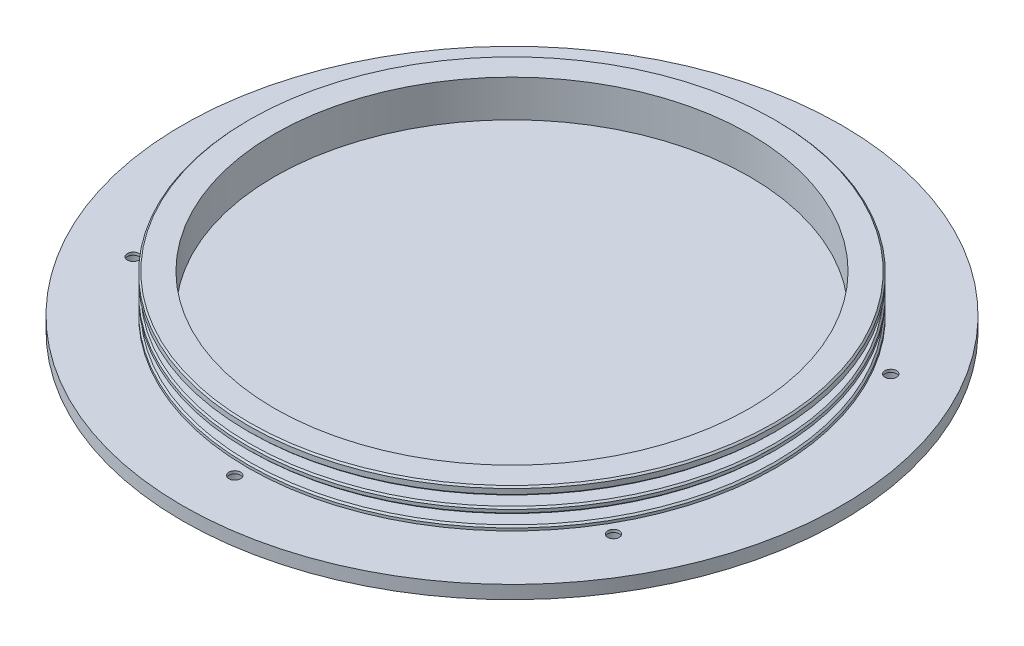
ISO-10303-21;
HEADER;
FILE_DESCRIPTION(('STEP AP214'),'2;1');
FILE_NAME('part.step','',(''),(''),'','','');
FILE_SCHEMA(('AUTOMOTIVE_DESIGN { 1 0 10303 214 1 1 1 1 }'));
ENDSEC;
DATA;
#1=APPLICATION_CONTEXT('core data for automotive mechanical design processes');
#2=APPLICATION_PROTOCOL_DEFINITION('international standard','automotive_design',2000,#1);
#3=PRODUCT_CONTEXT('',#1,'mechanical');
#4=PRODUCT('Part','Part','',(#3));
#5=PRODUCT_RELATED_PRODUCT_CATEGORY('part','',(#4));
#6=PRODUCT_DEFINITION_FORMATION('','',#4);
#7=PRODUCT_DEFINITION_CONTEXT('part definition',#1,'design');
#8=PRODUCT_DEFINITION('design','',#6,#7);
#9=PRODUCT_DEFINITION_SHAPE('','',#8);
#10=(LENGTH_UNIT() NAMED_UNIT(*) SI_UNIT(.MILLI.,.METRE.));
#11=(NAMED_UNIT(*) PLANE_ANGLE_UNIT() SI_UNIT($,.RADIAN.));
#12=(NAMED_UNIT(*) SI_UNIT($,.STERADIAN.) SOLID_ANGLE_UNIT());
#13=UNCERTAINTY_MEASURE_WITH_UNIT(LENGTH_MEASURE(1.E-05),#10,'distance_accuracy_value','');
#14=(GEOMETRIC_REPRESENTATION_CONTEXT(3) GLOBAL_UNCERTAINTY_ASSIGNED_CONTEXT((#13)) GLOBAL_UNIT_ASSIGNED_CONTEXT((#10,
#11,#12)) REPRESENTATION_CONTEXT('',''));
#15=CARTESIAN_POINT('',(0.,0.,0.));
#16=DIRECTION('',(0.,0.,1.));
#17=DIRECTION('',(1.,0.,0.));
#18=AXIS2_PLACEMENT_3D('',#15,#16,#17);
#19=CARTESIAN_POINT('',(0.,12.3825,0.));
#20=DIRECTION('',(0.,-1.,0.));
#21=DIRECTION('',(0.,0.,-1.));
#22=AXIS2_PLACEMENT_3D('',#19,#20,#21);
#23=CYLINDRICAL_SURFACE('',#22,63.5);
#24=CARTESIAN_POINT('',(0.,6.92263972647447,0.));
#25=DIRECTION('',(0.,-1.,0.));
#26=DIRECTION('',(0.,0.,-1.));
#27=AXIS2_PLACEMENT_3D('',#24,#25,#26);
#28=CIRCLE('',#27,63.5);
#29=CARTESIAN_POINT('',(0.,6.92263972647447,-63.5));
#30=VERTEX_POINT('',#29);
#31=EDGE_CURVE('E45',#30,#30,#28,.F.);
#32=ORIENTED_EDGE('',*,*,#31,.T.);
#33=EDGE_LOOP('',(#32));
#34=FACE_BOUND('',#33,.T.);
#35=CARTESIAN_POINT('',(0.,7.66193475746577,0.));
#36=DIRECTION('',(0.,1.,0.));
#37=DIRECTION('',(0.,0.,1.));
#38=AXIS2_PLACEMENT_3D('',#35,#36,#37);
#39=CIRCLE('',#38,63.5);
#40=CARTESIAN_POINT('',(0.,7.66193475746577,63.5));
#41=VERTEX_POINT('',#40);
#42=EDGE_CURVE('E156',#41,#41,#39,.F.);
#43=ORIENTED_EDGE('',*,*,#42,.T.);
#44=EDGE_LOOP('',(#43));
#45=FACE_BOUND('',#44,.T.);
#46=ADVANCED_FACE('F32',(#34,#45),#23,.T.);
#47=CARTESIAN_POINT('',(0.,8.04293475746576,63.5));
#48=DIRECTION('',(0.,1.,0.));
#49=DIRECTION('',(0.,0.,1.));
#50=AXIS2_PLACEMENT_3D('',#47,#48,#49);
#51=PLANE('',#50);
#52=CARTESIAN_POINT('',(0.,8.04293475746576,0.));
#53=DIRECTION('',(0.,1.,0.));
#54=DIRECTION('',(0.,0.,1.));
#55=AXIS2_PLACEMENT_3D('',#52,#53,#54);
#56=CIRCLE('',#55,63.119);
#57=CARTESIAN_POINT('',(0.,8.04293475746576,63.119));
#58=VERTEX_POINT('',#57);
#59=EDGE_CURVE('E40',#58,#58,#56,.T.);
#60=ORIENTED_EDGE('',*,*,#59,.T.);
#61=EDGE_LOOP('',(#60));
#62=FACE_BOUND('',#61,.T.);
#63=CARTESIAN_POINT('',(0.,8.04293475746576,0.));
#64=DIRECTION('',(0.,-1.,0.));
#65=DIRECTION('',(0.,0.,-1.));
#66=AXIS2_PLACEMENT_3D('',#63,#64,#65);
#67=CIRCLE('',#66,59.69);
#68=CARTESIAN_POINT('',(0.,8.04293475746576,-59.69));
#69=VERTEX_POINT('',#68);
#70=EDGE_CURVE('E126',#69,#69,#67,.T.);
#71=ORIENTED_EDGE('',*,*,#70,.T.);
#72=EDGE_LOOP('',(#71));
#73=FACE_BOUND('',#72,.T.);
#74=ADVANCED_FACE('F198',(#62,#73),#51,.T.);
#75=CARTESIAN_POINT('',(0.,0.,0.));
#76=DIRECTION('',(0.,-1.,0.));
#77=DIRECTION('',(0.,0.,-1.));
#78=AXIS2_PLACEMENT_3D('',#75,#76,#77);
#79=CYLINDRICAL_SURFACE('',#78,59.69);
#80=CARTESIAN_POINT('',(0.,10.4051347574658,0.));
#81=DIRECTION('',(0.,-1.,0.));
#82=DIRECTION('',(0.,0.,-1.));
#83=AXIS2_PLACEMENT_3D('',#80,#81,#82);
#84=CIRCLE('',#83,59.69);
#85=CARTESIAN_POINT('',(0.,10.4051347574658,-59.69));
#86=VERTEX_POINT('',#85);
#87=EDGE_CURVE('E123',#86,#86,#84,.T.);
#88=ORIENTED_EDGE('',*,*,#87,.T.);
#89=EDGE_LOOP('',(#88));
#90=FACE_BOUND('',#89,.T.);
#91=ORIENTED_EDGE('',*,*,#70,.F.);
#92=EDGE_LOOP('',(#91));
#93=FACE_BOUND('',#92,.T.);
#94=ADVANCED_FACE('F202',(#90,#93),#79,.T.);
#95=CARTESIAN_POINT('',(0.,10.4051347574658,63.5));
#96=DIRECTION('',(0.,-1.,0.));
#97=DIRECTION('',(0.,0.,-1.));
#98=AXIS2_PLACEMENT_3D('',#95,#96,#97);
#99=PLANE('',#98);
#100=CARTESIAN_POINT('',(0.,10.4051347574658,0.));
#101=DIRECTION('',(0.,-1.,0.));
#102=DIRECTION('',(0.,0.,-1.));
#103=AXIS2_PLACEMENT_3D('',#100,#101,#102);
#104=CIRCLE('',#103,63.119);
#105=CARTESIAN_POINT('',(0.,10.4051347574658,-63.119));
#106=VERTEX_POINT('',#105);
#107=EDGE_CURVE('E10',#106,#106,#104,.T.);
#108=ORIENTED_EDGE('',*,*,#107,.T.);
#109=EDGE_LOOP('',(#108));
#110=FACE_BOUND('',#109,.T.);
#111=ORIENTED_EDGE('',*,*,#87,.F.);
#112=EDGE_LOOP('',(#111));
#113=FACE_BOUND('',#112,.T.);
#114=ADVANCED_FACE('F245',(#110,#113),#99,.T.);
#115=CARTESIAN_POINT('',(0.,12.3825,0.));
#116=DIRECTION('',(0.,1.,0.));
#117=DIRECTION('',(0.,0.,1.));
#118=AXIS2_PLACEMENT_3D('',#115,#116,#117);
#119=PLANE('',#118);
#120=CARTESIAN_POINT('',(0.,12.3825,0.));
#121=DIRECTION('',(0.,1.,0.));
#122=DIRECTION('',(0.,0.,1.));
#123=AXIS2_PLACEMENT_3D('',#120,#121,#122);
#124=CIRCLE('',#123,57.15);
#125=CARTESIAN_POINT('',(0.,12.3825,57.15));
#126=VERTEX_POINT('',#125);
#127=EDGE_CURVE('E52',#126,#126,#124,.T.);
#128=ORIENTED_EDGE('',*,*,#127,.F.);
#129=EDGE_LOOP('',(#128));
#130=FACE_BOUND('',#129,.T.);
#131=CARTESIAN_POINT('',(0.,12.3825,0.));
#132=DIRECTION('',(0.,1.,0.));
#133=DIRECTION('',(0.,0.,1.));
#134=AXIS2_PLACEMENT_3D('',#131,#132,#133);
#135=CIRCLE('',#134,63.119);
#136=CARTESIAN_POINT('',(0.,12.3825,63.119));
#137=VERTEX_POINT('',#136);
#138=EDGE_CURVE('E136',#137,#137,#135,.T.);
#139=ORIENTED_EDGE('',*,*,#138,.T.);
#140=EDGE_LOOP('',(#139));
#141=FACE_BOUND('',#140,.T.);
#142=ADVANCED_FACE('F192',(#130,#141),#119,.T.);
#143=CARTESIAN_POINT('',(0.,12.0015,0.));
#144=DIRECTION('',(0.,1.,0.));
#145=DIRECTION('',(0.,0.,1.));
#146=AXIS2_PLACEMENT_3D('',#143,#144,#145);
#147=CIRCLE('',#146,63.5);
#148=CARTESIAN_POINT('',(0.,12.0015,63.5));
#149=VERTEX_POINT('',#148);
#150=EDGE_CURVE('E144',#149,#149,#147,.F.);
#151=ORIENTED_EDGE('',*,*,#150,.T.);
#152=EDGE_LOOP('',(#151));
#153=FACE_BOUND('',#152,.T.);
#154=CARTESIAN_POINT('',(0.,10.7861347574657,0.));
#155=DIRECTION('',(0.,-1.,0.));
#156=DIRECTION('',(0.,0.,-1.));
#157=AXIS2_PLACEMENT_3D('',#154,#155,#156);
#158=CIRCLE('',#157,63.5);
#159=CARTESIAN_POINT('',(0.,10.7861347574657,-63.5));
#160=VERTEX_POINT('',#159);
#161=EDGE_CURVE('E141',#160,#160,#158,.F.);
#162=ORIENTED_EDGE('',*,*,#161,.T.);
#163=EDGE_LOOP('',(#162));
#164=FACE_BOUND('',#163,.T.);
#165=ADVANCED_FACE('F186',(#153,#164),#23,.T.);
#166=CARTESIAN_POINT('',(0.,4.1794397264745,63.5));
#167=DIRECTION('',(0.,1.,0.));
#168=DIRECTION('',(0.,0.,1.));
#169=AXIS2_PLACEMENT_3D('',#166,#167,#168);
#170=PLANE('',#169);
#171=CARTESIAN_POINT('',(0.,4.1794397264745,0.));
#172=DIRECTION('',(0.,1.,0.));
#173=DIRECTION('',(0.,0.,1.));
#174=AXIS2_PLACEMENT_3D('',#171,#172,#173);
#175=CIRCLE('',#174,63.119);
#176=CARTESIAN_POINT('',(0.,4.1794397264745,63.119));
#177=VERTEX_POINT('',#176);
#178=EDGE_CURVE('E150',#177,#177,#175,.T.);
#179=ORIENTED_EDGE('',*,*,#178,.T.);
#180=EDGE_LOOP('',(#179));
#181=FACE_BOUND('',#180,.T.);
#182=CARTESIAN_POINT('',(0.,4.1794397264745,0.));
#183=DIRECTION('',(0.,-1.,0.));
#184=DIRECTION('',(0.,0.,-1.));
#185=AXIS2_PLACEMENT_3D('',#182,#183,#184);
#186=CIRCLE('',#185,59.69);
#187=CARTESIAN_POINT('',(0.,4.1794397264745,-59.69));
#188=VERTEX_POINT('',#187);
#189=EDGE_CURVE('E120',#188,#188,#186,.T.);
#190=ORIENTED_EDGE('',*,*,#189,.T.);
#191=EDGE_LOOP('',(#190));
#192=FACE_BOUND('',#191,.T.);
#193=ADVANCED_FACE('F181',(#181,#192),#170,.T.);
#194=CARTESIAN_POINT('',(0.,0.,0.));
#195=DIRECTION('',(0.,-1.,0.));
#196=DIRECTION('',(0.,0.,-1.));
#197=AXIS2_PLACEMENT_3D('',#194,#195,#196);
#198=CYLINDRICAL_SURFACE('',#197,59.69);
#199=CARTESIAN_POINT('',(0.,6.5416397264745,0.));
#200=DIRECTION('',(0.,-1.,0.));
#201=DIRECTION('',(0.,0.,-1.));
#202=AXIS2_PLACEMENT_3D('',#199,#200,#201);
#203=CIRCLE('',#202,59.69);
#204=CARTESIAN_POINT('',(0.,6.5416397264745,-59.69));
#205=VERTEX_POINT('',#204);
#206=EDGE_CURVE('E115',#205,#205,#203,.T.);
#207=ORIENTED_EDGE('',*,*,#206,.T.);
#208=EDGE_LOOP('',(#207));
#209=FACE_BOUND('',#208,.T.);
#210=ORIENTED_EDGE('',*,*,#189,.F.);
#211=EDGE_LOOP('',(#210));
#212=FACE_BOUND('',#211,.T.);
#213=ADVANCED_FACE('F175',(#209,#212),#198,.T.);
#214=CARTESIAN_POINT('',(0.,6.5416397264745,63.5));
#215=DIRECTION('',(0.,-1.,0.));
#216=DIRECTION('',(0.,0.,-1.));
#217=AXIS2_PLACEMENT_3D('',#214,#215,#216);
#218=PLANE('',#217);
#219=CARTESIAN_POINT('',(0.,6.5416397264745,0.));
#220=DIRECTION('',(0.,-1.,0.));
#221=DIRECTION('',(0.,0.,-1.));
#222=AXIS2_PLACEMENT_3D('',#219,#220,#221);
#223=CIRCLE('',#222,63.119);
#224=CARTESIAN_POINT('',(0.,6.5416397264745,-63.119));
#225=VERTEX_POINT('',#224);
#226=EDGE_CURVE('E153',#225,#225,#223,.T.);
#227=ORIENTED_EDGE('',*,*,#226,.T.);
#228=EDGE_LOOP('',(#227));
#229=FACE_BOUND('',#228,.T.);
#230=ORIENTED_EDGE('',*,*,#206,.F.);
#231=EDGE_LOOP('',(#230));
#232=FACE_BOUND('',#231,.T.);
#233=ADVANCED_FACE('F171',(#229,#232),#218,.T.);
#234=CARTESIAN_POINT('',(0.,0.,0.));
#235=DIRECTION('',(0.,1.,0.));
#236=DIRECTION('',(0.,0.,1.));
#237=AXIS2_PLACEMENT_3D('',#234,#235,#236);
#238=PLANE('',#237);
#239=CARTESIAN_POINT('',(57.7422437973278,0.,-33.3374999999993));
#240=DIRECTION('',(0.,-1.,0.));
#241=DIRECTION('',(0.,0.,-1.));
#242=AXIS2_PLACEMENT_3D('',#239,#240,#241);
#243=CIRCLE('',#242,2.57937);
#244=CARTESIAN_POINT('',(57.7422437973278,0.,-35.9168699999993));
#245=VERTEX_POINT('',#244);
#246=EDGE_CURVE('E352',#245,#245,#243,.T.);
#247=ORIENTED_EDGE('',*,*,#246,.F.);
#248=EDGE_LOOP('',(#247));
#249=FACE_BOUND('',#248,.T.);
#250=CARTESIAN_POINT('',(6.17561557447743E-13,0.,-66.675));
#251=DIRECTION('',(0.,-1.,0.));
#252=DIRECTION('',(0.,0.,-1.));
#253=AXIS2_PLACEMENT_3D('',#250,#251,#252);
#254=CIRCLE('',#253,2.57937);
#255=CARTESIAN_POINT('',(6.17561557447743E-13,0.,-69.25437));
#256=VERTEX_POINT('',#255);
#257=EDGE_CURVE('E71',#256,#256,#254,.T.);
#258=ORIENTED_EDGE('',*,*,#257,.F.);
#259=EDGE_LOOP('',(#258));
#260=FACE_BOUND('',#259,.T.);
#261=CARTESIAN_POINT('',(-57.7422437973272,0.,-33.3375000000004));
#262=DIRECTION('',(0.,-1.,0.));
#263=DIRECTION('',(0.,0.,-1.));
#264=AXIS2_PLACEMENT_3D('',#261,#262,#263);
#265=CIRCLE('',#264,2.57937);
#266=CARTESIAN_POINT('',(-57.7422437973272,0.,-35.9168700000004));
#267=VERTEX_POINT('',#266);
#268=EDGE_CURVE('E67',#267,#267,#265,.T.);
#269=ORIENTED_EDGE('',*,*,#268,.F.);
#270=EDGE_LOOP('',(#269));
#271=FACE_BOUND('',#270,.T.);
#272=CARTESIAN_POINT('',(-57.7422437973276,0.,33.3374999999997));
#273=DIRECTION('',(0.,-1.,0.));
#274=DIRECTION('',(0.,0.,-1.));
#275=AXIS2_PLACEMENT_3D('',#272,#273,#274);
#276=CIRCLE('',#275,2.57937);
#277=CARTESIAN_POINT('',(-57.7422437973276,0.,30.7581299999997));
#278=VERTEX_POINT('',#277);
#279=EDGE_CURVE('E63',#278,#278,#276,.T.);
#280=ORIENTED_EDGE('',*,*,#279,.F.);
#281=EDGE_LOOP('',(#280));
#282=FACE_BOUND('',#281,.T.);
#283=CARTESIAN_POINT('',(-1.52655665885959E-13,0.,66.675));
#284=DIRECTION('',(0.,-1.,0.));
#285=DIRECTION('',(0.,0.,-1.));
#286=AXIS2_PLACEMENT_3D('',#283,#284,#285);
#287=CIRCLE('',#286,2.57937);
#288=CARTESIAN_POINT('',(-1.52655665885959E-13,0.,64.09563));
#289=VERTEX_POINT('',#288);
#290=EDGE_CURVE('E58',#289,#289,#287,.T.);
#291=ORIENTED_EDGE('',*,*,#290,.F.);
#292=EDGE_LOOP('',(#291));
#293=FACE_BOUND('',#292,.T.);
#294=CARTESIAN_POINT('',(57.7422437973274,0.,33.3375));
#295=DIRECTION('',(0.,-1.,0.));
#296=DIRECTION('',(0.,0.,-1.));
#297=AXIS2_PLACEMENT_3D('',#294,#295,#296);
#298=CIRCLE('',#297,2.57937);
#299=CARTESIAN_POINT('',(57.7422437973274,0.,30.75813));
#300=VERTEX_POINT('',#299);
#301=EDGE_CURVE('E53',#300,#300,#298,.T.);
#302=ORIENTED_EDGE('',*,*,#301,.F.);
#303=EDGE_LOOP('',(#302));
#304=FACE_BOUND('',#303,.T.);
#305=CARTESIAN_POINT('',(0.,0.,0.));
#306=DIRECTION('',(0.,1.,0.));
#307=DIRECTION('',(0.,0.,1.));
#308=AXIS2_PLACEMENT_3D('',#305,#306,#307);
#309=CIRCLE('',#308,79.248);
#310=CARTESIAN_POINT('',(0.,0.,79.248));
#311=VERTEX_POINT('',#310);
#312=EDGE_CURVE('E132',#311,#311,#309,.T.);
#313=ORIENTED_EDGE('',*,*,#312,.F.);
#314=EDGE_LOOP('',(#313));
#315=FACE_BOUND('',#314,.T.);
#316=ADVANCED_FACE('F174',(#249,#260,#271,#282,#293,#304,#315),#238,.F.);
#317=CARTESIAN_POINT('',(0.,3.175,0.));
#318=DIRECTION('',(0.,-1.,0.));
#319=DIRECTION('',(0.,0.,-1.));
#320=AXIS2_PLACEMENT_3D('',#317,#318,#319);
#321=CYLINDRICAL_SURFACE('',#320,79.248);
#322=CARTESIAN_POINT('',(0.,3.175,0.));
#323=DIRECTION('',(0.,1.,0.));
#324=DIRECTION('',(0.,0.,1.));
#325=AXIS2_PLACEMENT_3D('',#322,#323,#324);
#326=CIRCLE('',#325,79.248);
#327=CARTESIAN_POINT('',(0.,3.175,79.248));
#328=VERTEX_POINT('',#327);
#329=EDGE_CURVE('E133',#328,#328,#326,.T.);
#330=ORIENTED_EDGE('',*,*,#329,.F.);
#331=EDGE_LOOP('',(#330));
#332=FACE_BOUND('',#331,.T.);
#333=ORIENTED_EDGE('',*,*,#312,.T.);
#334=EDGE_LOOP('',(#333));
#335=FACE_BOUND('',#334,.T.);
#336=ADVANCED_FACE('F217',(#332,#335),#321,.T.);
#337=CARTESIAN_POINT('',(0.,3.175,0.));
#338=DIRECTION('',(0.,1.,0.));
#339=DIRECTION('',(0.,0.,1.));
#340=AXIS2_PLACEMENT_3D('',#337,#338,#339);
#341=PLANE('',#340);
#342=CARTESIAN_POINT('',(57.7422437973278,3.175,-33.3374999999993));
#343=DIRECTION('',(0.,1.,0.));
#344=DIRECTION('',(0.,0.,1.));
#345=AXIS2_PLACEMENT_3D('',#342,#343,#344);
#346=CIRCLE('',#345,1.397);
#347=CARTESIAN_POINT('',(57.7422437973278,3.175,-31.9404999999993));
#348=VERTEX_POINT('',#347);
#349=EDGE_CURVE('E36',#348,#348,#346,.T.);
#350=ORIENTED_EDGE('',*,*,#349,.F.);
#351=EDGE_LOOP('',(#350));
#352=FACE_BOUND('',#351,.T.);
#353=CARTESIAN_POINT('',(6.17561557447743E-13,3.175,-66.675));
#354=DIRECTION('',(0.,1.,0.));
#355=DIRECTION('',(0.,0.,1.));
#356=AXIS2_PLACEMENT_3D('',#353,#354,#355);
#357=CIRCLE('',#356,1.397);
#358=CARTESIAN_POINT('',(6.17561557447743E-13,3.175,-65.278));
#359=VERTEX_POINT('',#358);
#360=EDGE_CURVE('E68',#359,#359,#357,.T.);
#361=ORIENTED_EDGE('',*,*,#360,.F.);
#362=EDGE_LOOP('',(#361));
#363=FACE_BOUND('',#362,.T.);
#364=CARTESIAN_POINT('',(-57.7422437973272,3.175,-33.3375000000004));
#365=DIRECTION('',(0.,1.,0.));
#366=DIRECTION('',(0.,0.,1.));
#367=AXIS2_PLACEMENT_3D('',#364,#365,#366);
#368=CIRCLE('',#367,1.397);
#369=CARTESIAN_POINT('',(-57.7422437973272,3.175,-31.9405000000004));
#370=VERTEX_POINT('',#369);
#371=EDGE_CURVE('E64',#370,#370,#368,.T.);
#372=ORIENTED_EDGE('',*,*,#371,.F.);
#373=EDGE_LOOP('',(#372));
#374=FACE_BOUND('',#373,.T.);
#375=CARTESIAN_POINT('',(-57.7422437973276,3.175,33.3374999999997));
#376=DIRECTION('',(0.,1.,0.));
#377=DIRECTION('',(0.,0.,1.));
#378=AXIS2_PLACEMENT_3D('',#375,#376,#377);
#379=CIRCLE('',#378,1.397);
#380=CARTESIAN_POINT('',(-57.7422437973276,3.175,34.7344999999997));
#381=VERTEX_POINT('',#380);
#382=EDGE_CURVE('E59',#381,#381,#379,.T.);
#383=ORIENTED_EDGE('',*,*,#382,.F.);
#384=EDGE_LOOP('',(#383));
#385=FACE_BOUND('',#384,.T.);
#386=CARTESIAN_POINT('',(-1.52655665885959E-13,3.175,66.675));
#387=DIRECTION('',(0.,1.,0.));
#388=DIRECTION('',(0.,0.,1.));
#389=AXIS2_PLACEMENT_3D('',#386,#387,#388);
#390=CIRCLE('',#389,1.397);
#391=CARTESIAN_POINT('',(-1.52655665885959E-13,3.175,68.072));
#392=VERTEX_POINT('',#391);
#393=EDGE_CURVE('E54',#392,#392,#390,.T.);
#394=ORIENTED_EDGE('',*,*,#393,.F.);
#395=EDGE_LOOP('',(#394));
#396=FACE_BOUND('',#395,.T.);
#397=CARTESIAN_POINT('',(57.7422437973274,3.175,33.3375));
#398=DIRECTION('',(0.,1.,0.));
#399=DIRECTION('',(0.,0.,1.));
#400=AXIS2_PLACEMENT_3D('',#397,#398,#399);
#401=CIRCLE('',#400,1.397);
#402=CARTESIAN_POINT('',(57.7422437973274,3.175,34.7345));
#403=VERTEX_POINT('',#402);
#404=EDGE_CURVE('E49',#403,#403,#401,.T.);
#405=ORIENTED_EDGE('',*,*,#404,.F.);
#406=EDGE_LOOP('',(#405));
#407=FACE_BOUND('',#406,.T.);
#408=ORIENTED_EDGE('',*,*,#329,.T.);
#409=EDGE_LOOP('',(#408));
#410=FACE_BOUND('',#409,.T.);
#411=CARTESIAN_POINT('',(0.,3.175,0.));
#412=DIRECTION('',(0.,1.,0.));
#413=DIRECTION('',(0.,0.,1.));
#414=AXIS2_PLACEMENT_3D('',#411,#412,#413);
#415=CIRCLE('',#414,63.5);
#416=CARTESIAN_POINT('',(0.,3.175,63.5));
#417=VERTEX_POINT('',#416);
#418=EDGE_CURVE('E129',#417,#417,#415,.T.);
#419=ORIENTED_EDGE('',*,*,#418,.F.);
#420=EDGE_LOOP('',(#419));
#421=FACE_BOUND('',#420,.T.);
#422=ADVANCED_FACE('F209',(#352,#363,#374,#385,#396,#407,#410,#421),#341,.T.);
#423=CARTESIAN_POINT('',(0.,3.79843972647449,0.));
#424=DIRECTION('',(0.,1.,0.));
#425=DIRECTION('',(0.,0.,1.));
#426=AXIS2_PLACEMENT_3D('',#423,#424,#425);
#427=CIRCLE('',#426,63.5);
#428=CARTESIAN_POINT('',(0.,3.79843972647449,63.5));
#429=VERTEX_POINT('',#428);
#430=EDGE_CURVE('E147',#429,#429,#427,.F.);
#431=ORIENTED_EDGE('',*,*,#430,.T.);
#432=EDGE_LOOP('',(#431));
#433=FACE_BOUND('',#432,.T.);
#434=ORIENTED_EDGE('',*,*,#418,.T.);
#435=EDGE_LOOP('',(#434));
#436=FACE_BOUND('',#435,.T.);
#437=ADVANCED_FACE('F195',(#433,#436),#23,.T.);
#438=CARTESIAN_POINT('',(0.,12.3825,0.));
#439=DIRECTION('',(0.,-1.,0.));
#440=DIRECTION('',(0.,0.,-1.));
#441=AXIS2_PLACEMENT_3D('',#438,#439,#440);
#442=CONICAL_SURFACE('',#441,63.119,0.785398163397466);
#443=ORIENTED_EDGE('',*,*,#150,.F.);
#444=EDGE_LOOP('',(#443));
#445=FACE_BOUND('',#444,.T.);
#446=ORIENTED_EDGE('',*,*,#138,.F.);
#447=EDGE_LOOP('',(#446));
#448=FACE_BOUND('',#447,.T.);
#449=ADVANCED_FACE('F208',(#445,#448),#442,.T.);
#450=CARTESIAN_POINT('',(0.,3.79843972647449,0.));
#451=DIRECTION('',(0.,-1.,0.));
#452=DIRECTION('',(0.,0.,-1.));
#453=AXIS2_PLACEMENT_3D('',#450,#451,#452);
#454=CONICAL_SURFACE('',#453,63.5,0.78539816339743);
#455=ORIENTED_EDGE('',*,*,#178,.F.);
#456=EDGE_LOOP('',(#455));
#457=FACE_BOUND('',#456,.T.);
#458=ORIENTED_EDGE('',*,*,#430,.F.);
#459=EDGE_LOOP('',(#458));
#460=FACE_BOUND('',#459,.T.);
#461=ADVANCED_FACE('F167',(#457,#460),#454,.T.);
#462=CARTESIAN_POINT('',(0.,6.5416397264745,0.));
#463=DIRECTION('',(0.,1.,0.));
#464=DIRECTION('',(0.,0.,1.));
#465=AXIS2_PLACEMENT_3D('',#462,#463,#464);
#466=CONICAL_SURFACE('',#465,63.119,0.785398163397466);
#467=ORIENTED_EDGE('',*,*,#31,.F.);
#468=EDGE_LOOP('',(#467));
#469=FACE_BOUND('',#468,.T.);
#470=ORIENTED_EDGE('',*,*,#226,.F.);
#471=EDGE_LOOP('',(#470));
#472=FACE_BOUND('',#471,.T.);
#473=ADVANCED_FACE('F163',(#469,#472),#466,.T.);
#474=CARTESIAN_POINT('',(0.,7.66193475746577,0.));
#475=DIRECTION('',(0.,-1.,0.));
#476=DIRECTION('',(0.,0.,-1.));
#477=AXIS2_PLACEMENT_3D('',#474,#475,#476);
#478=CONICAL_SURFACE('',#477,63.5,0.78539816339743);
#479=ORIENTED_EDGE('',*,*,#59,.F.);
#480=EDGE_LOOP('',(#479));
#481=FACE_BOUND('',#480,.T.);
#482=ORIENTED_EDGE('',*,*,#42,.F.);
#483=EDGE_LOOP('',(#482));
#484=FACE_BOUND('',#483,.T.);
#485=ADVANCED_FACE('F166',(#481,#484),#478,.T.);
#486=CARTESIAN_POINT('',(0.,10.4051347574658,0.));
#487=DIRECTION('',(0.,1.,0.));
#488=DIRECTION('',(0.,0.,1.));
#489=AXIS2_PLACEMENT_3D('',#486,#487,#488);
#490=CONICAL_SURFACE('',#489,63.119,0.785398163397466);
#491=ORIENTED_EDGE('',*,*,#161,.F.);
#492=EDGE_LOOP('',(#491));
#493=FACE_BOUND('',#492,.T.);
#494=ORIENTED_EDGE('',*,*,#107,.F.);
#495=EDGE_LOOP('',(#494));
#496=FACE_BOUND('',#495,.T.);
#497=ADVANCED_FACE('F34',(#493,#496),#490,.T.);
#498=CARTESIAN_POINT('',(0.,3.4925,0.));
#499=DIRECTION('',(0.,1.,0.));
#500=DIRECTION('',(0.,0.,1.));
#501=AXIS2_PLACEMENT_3D('',#498,#499,#500);
#502=CYLINDRICAL_SURFACE('',#501,57.15);
#503=CARTESIAN_POINT('',(0.,3.4925,0.));
#504=DIRECTION('',(0.,1.,0.));
#505=DIRECTION('',(0.,0.,1.));
#506=AXIS2_PLACEMENT_3D('',#503,#504,#505);
#507=CIRCLE('',#506,57.15);
#508=CARTESIAN_POINT('',(0.,3.4925,57.15));
#509=VERTEX_POINT('',#508);
#510=EDGE_CURVE('E112',#509,#509,#507,.T.);
#511=ORIENTED_EDGE('',*,*,#510,.F.);
#512=EDGE_LOOP('',(#511));
#513=FACE_BOUND('',#512,.T.);
#514=ORIENTED_EDGE('',*,*,#127,.T.);
#515=EDGE_LOOP('',(#514));
#516=FACE_BOUND('',#515,.T.);
#517=ADVANCED_FACE('F236',(#513,#516),#502,.F.);
#518=CARTESIAN_POINT('',(0.,3.4925,0.));
#519=DIRECTION('',(0.,1.,0.));
#520=DIRECTION('',(0.,0.,1.));
#521=AXIS2_PLACEMENT_3D('',#518,#519,#520);
#522=PLANE('',#521);
#523=ORIENTED_EDGE('',*,*,#510,.T.);
#524=EDGE_LOOP('',(#523));
#525=FACE_BOUND('',#524,.T.);
#526=ADVANCED_FACE('F261',(#525),#522,.T.);
#527=CARTESIAN_POINT('',(57.7422437973274,0.,33.3375));
#528=DIRECTION('',(0.,-1.,0.));
#529=DIRECTION('',(0.,0.,-1.));
#530=AXIS2_PLACEMENT_3D('',#527,#528,#529);
#531=CYLINDRICAL_SURFACE('',#530,2.57937);
#532=CARTESIAN_POINT('',(57.7422437973274,2.5146,33.3375));
#533=DIRECTION('',(0.,-1.,0.));
#534=DIRECTION('',(0.,0.,-1.));
#535=AXIS2_PLACEMENT_3D('',#532,#533,#534);
#536=CIRCLE('',#535,2.57937);
#537=CARTESIAN_POINT('',(57.7422437973274,2.5146,30.75813));
#538=VERTEX_POINT('',#537);
#539=EDGE_CURVE('E107',#538,#538,#536,.T.);
#540=ORIENTED_EDGE('',*,*,#539,.F.);
#541=EDGE_LOOP('',(#540));
#542=FACE_BOUND('',#541,.T.);
#543=ORIENTED_EDGE('',*,*,#301,.T.);
#544=EDGE_LOOP('',(#543));
#545=FACE_BOUND('',#544,.T.);
#546=ADVANCED_FACE('F267',(#542,#545),#531,.F.);
#547=CARTESIAN_POINT('',(59.1392437973274,2.5146,33.3375));
#548=DIRECTION('',(0.,1.,0.));
#549=DIRECTION('',(0.,0.,1.));
#550=AXIS2_PLACEMENT_3D('',#547,#548,#549);
#551=PLANE('',#550);
#552=CARTESIAN_POINT('',(57.7422437973274,2.5146,33.3375));
#553=DIRECTION('',(0.,-1.,0.));
#554=DIRECTION('',(0.,0.,-1.));
#555=AXIS2_PLACEMENT_3D('',#552,#553,#554);
#556=CIRCLE('',#555,1.397);
#557=CARTESIAN_POINT('',(57.7422437973274,2.5146,31.9405));
#558=VERTEX_POINT('',#557);
#559=EDGE_CURVE('E57',#558,#558,#556,.T.);
#560=ORIENTED_EDGE('',*,*,#559,.F.);
#561=EDGE_LOOP('',(#560));
#562=FACE_BOUND('',#561,.T.);
#563=ORIENTED_EDGE('',*,*,#539,.T.);
#564=EDGE_LOOP('',(#563));
#565=FACE_BOUND('',#564,.T.);
#566=ADVANCED_FACE('F274',(#562,#565),#551,.F.);
#567=CARTESIAN_POINT('',(57.7422437973274,0.,33.3375));
#568=DIRECTION('',(0.,-1.,0.));
#569=DIRECTION('',(0.,0.,-1.));
#570=AXIS2_PLACEMENT_3D('',#567,#568,#569);
#571=CYLINDRICAL_SURFACE('',#570,1.397);
#572=ORIENTED_EDGE('',*,*,#404,.T.);
#573=EDGE_LOOP('',(#572));
#574=FACE_BOUND('',#573,.T.);
#575=ORIENTED_EDGE('',*,*,#559,.T.);
#576=EDGE_LOOP('',(#575));
#577=FACE_BOUND('',#576,.T.);
#578=ADVANCED_FACE('F278',(#574,#577),#571,.F.);
#579=CARTESIAN_POINT('',(-1.52655665885959E-13,0.,66.675));
#580=DIRECTION('',(0.,-1.,0.));
#581=DIRECTION('',(0.,0.,-1.));
#582=AXIS2_PLACEMENT_3D('',#579,#580,#581);
#583=CYLINDRICAL_SURFACE('',#582,2.57937);
#584=CARTESIAN_POINT('',(-1.52655665885959E-13,2.5146,66.675));
#585=DIRECTION('',(0.,-1.,0.));
#586=DIRECTION('',(0.,0.,-1.));
#587=AXIS2_PLACEMENT_3D('',#584,#585,#586);
#588=CIRCLE('',#587,2.57937);
#589=CARTESIAN_POINT('',(-1.52655665885959E-13,2.5146,64.09563));
#590=VERTEX_POINT('',#589);
#591=EDGE_CURVE('E100',#590,#590,#588,.T.);
#592=ORIENTED_EDGE('',*,*,#591,.F.);
#593=EDGE_LOOP('',(#592));
#594=FACE_BOUND('',#593,.T.);
#595=ORIENTED_EDGE('',*,*,#290,.T.);
#596=EDGE_LOOP('',(#595));
#597=FACE_BOUND('',#596,.T.);
#598=ADVANCED_FACE('F282',(#594,#597),#583,.F.);
#599=CARTESIAN_POINT('',(1.39699999999985,2.5146,66.675));
#600=DIRECTION('',(0.,1.,0.));
#601=DIRECTION('',(0.,0.,1.));
#602=AXIS2_PLACEMENT_3D('',#599,#600,#601);
#603=PLANE('',#602);
#604=CARTESIAN_POINT('',(-1.52655665885959E-13,2.5146,66.675));
#605=DIRECTION('',(0.,-1.,0.));
#606=DIRECTION('',(0.,0.,-1.));
#607=AXIS2_PLACEMENT_3D('',#604,#605,#606);
#608=CIRCLE('',#607,1.397);
#609=CARTESIAN_POINT('',(-1.52655665885959E-13,2.5146,65.278));
#610=VERTEX_POINT('',#609);
#611=EDGE_CURVE('E62',#610,#610,#608,.T.);
#612=ORIENTED_EDGE('',*,*,#611,.F.);
#613=EDGE_LOOP('',(#612));
#614=FACE_BOUND('',#613,.T.);
#615=ORIENTED_EDGE('',*,*,#591,.T.);
#616=EDGE_LOOP('',(#615));
#617=FACE_BOUND('',#616,.T.);
#618=ADVANCED_FACE('F286',(#614,#617),#603,.F.);
#619=CARTESIAN_POINT('',(-1.52655665885959E-13,0.,66.675));
#620=DIRECTION('',(0.,-1.,0.));
#621=DIRECTION('',(0.,0.,-1.));
#622=AXIS2_PLACEMENT_3D('',#619,#620,#621);
#623=CYLINDRICAL_SURFACE('',#622,1.397);
#624=ORIENTED_EDGE('',*,*,#393,.T.);
#625=EDGE_LOOP('',(#624));
#626=FACE_BOUND('',#625,.T.);
#627=ORIENTED_EDGE('',*,*,#611,.T.);
#628=EDGE_LOOP('',(#627));
#629=FACE_BOUND('',#628,.T.);
#630=ADVANCED_FACE('F290',(#626,#629),#623,.F.);
#631=CARTESIAN_POINT('',(-57.7422437973276,0.,33.3374999999997));
#632=DIRECTION('',(0.,-1.,0.));
#633=DIRECTION('',(0.,0.,-1.));
#634=AXIS2_PLACEMENT_3D('',#631,#632,#633);
#635=CYLINDRICAL_SURFACE('',#634,2.57937);
#636=CARTESIAN_POINT('',(-57.7422437973276,2.5146,33.3374999999997));
#637=DIRECTION('',(0.,-1.,0.));
#638=DIRECTION('',(0.,0.,-1.));
#639=AXIS2_PLACEMENT_3D('',#636,#637,#638);
#640=CIRCLE('',#639,2.57937);
#641=CARTESIAN_POINT('',(-57.7422437973276,2.5146,30.7581299999997));
#642=VERTEX_POINT('',#641);
#643=EDGE_CURVE('E93',#642,#642,#640,.T.);
#644=ORIENTED_EDGE('',*,*,#643,.F.);
#645=EDGE_LOOP('',(#644));
#646=FACE_BOUND('',#645,.T.);
#647=ORIENTED_EDGE('',*,*,#279,.T.);
#648=EDGE_LOOP('',(#647));
#649=FACE_BOUND('',#648,.T.);
#650=ADVANCED_FACE('F294',(#646,#649),#635,.F.);
#651=CARTESIAN_POINT('',(-56.3452437973276,2.5146,33.3374999999997));
#652=DIRECTION('',(0.,1.,0.));
#653=DIRECTION('',(0.,0.,1.));
#654=AXIS2_PLACEMENT_3D('',#651,#652,#653);
#655=PLANE('',#654);
#656=CARTESIAN_POINT('',(-57.7422437973276,2.5146,33.3374999999997));
#657=DIRECTION('',(0.,-1.,0.));
#658=DIRECTION('',(0.,0.,-1.));
#659=AXIS2_PLACEMENT_3D('',#656,#657,#658);
#660=CIRCLE('',#659,1.397);
#661=CARTESIAN_POINT('',(-57.7422437973276,2.5146,31.9404999999997));
#662=VERTEX_POINT('',#661);
#663=EDGE_CURVE('E66',#662,#662,#660,.T.);
#664=ORIENTED_EDGE('',*,*,#663,.F.);
#665=EDGE_LOOP('',(#664));
#666=FACE_BOUND('',#665,.T.);
#667=ORIENTED_EDGE('',*,*,#643,.T.);
#668=EDGE_LOOP('',(#667));
#669=FACE_BOUND('',#668,.T.);
#670=ADVANCED_FACE('F298',(#666,#669),#655,.F.);
#671=CARTESIAN_POINT('',(-57.7422437973276,0.,33.3374999999997));
#672=DIRECTION('',(0.,-1.,0.));
#673=DIRECTION('',(0.,0.,-1.));
#674=AXIS2_PLACEMENT_3D('',#671,#672,#673);
#675=CYLINDRICAL_SURFACE('',#674,1.397);
#676=ORIENTED_EDGE('',*,*,#382,.T.);
#677=EDGE_LOOP('',(#676));
#678=FACE_BOUND('',#677,.T.);
#679=ORIENTED_EDGE('',*,*,#663,.T.);
#680=EDGE_LOOP('',(#679));
#681=FACE_BOUND('',#680,.T.);
#682=ADVANCED_FACE('F302',(#678,#681),#675,.F.);
#683=CARTESIAN_POINT('',(-57.7422437973272,0.,-33.3375000000004));
#684=DIRECTION('',(0.,-1.,0.));
#685=DIRECTION('',(0.,0.,-1.));
#686=AXIS2_PLACEMENT_3D('',#683,#684,#685);
#687=CYLINDRICAL_SURFACE('',#686,2.57937);
#688=CARTESIAN_POINT('',(-57.7422437973272,2.5146,-33.3375000000004));
#689=DIRECTION('',(0.,-1.,0.));
#690=DIRECTION('',(0.,0.,-1.));
#691=AXIS2_PLACEMENT_3D('',#688,#689,#690);
#692=CIRCLE('',#691,2.57937);
#693=CARTESIAN_POINT('',(-57.7422437973272,2.5146,-35.9168700000004));
#694=VERTEX_POINT('',#693);
#695=EDGE_CURVE('E75',#694,#694,#692,.T.);
#696=ORIENTED_EDGE('',*,*,#695,.F.);
#697=EDGE_LOOP('',(#696));
#698=FACE_BOUND('',#697,.T.);
#699=ORIENTED_EDGE('',*,*,#268,.T.);
#700=EDGE_LOOP('',(#699));
#701=FACE_BOUND('',#700,.T.);
#702=ADVANCED_FACE('F306',(#698,#701),#687,.F.);
#703=CARTESIAN_POINT('',(-56.3452437973272,2.5146,-33.3375000000004));
#704=DIRECTION('',(0.,1.,0.));
#705=DIRECTION('',(0.,0.,1.));
#706=AXIS2_PLACEMENT_3D('',#703,#704,#705);
#707=PLANE('',#706);
#708=CARTESIAN_POINT('',(-57.7422437973272,2.5146,-33.3375000000004));
#709=DIRECTION('',(0.,-1.,0.));
#710=DIRECTION('',(0.,0.,-1.));
#711=AXIS2_PLACEMENT_3D('',#708,#709,#710);
#712=CIRCLE('',#711,1.397);
#713=CARTESIAN_POINT('',(-57.7422437973272,2.5146,-34.7345000000004));
#714=VERTEX_POINT('',#713);
#715=EDGE_CURVE('E70',#714,#714,#712,.T.);
#716=ORIENTED_EDGE('',*,*,#715,.F.);
#717=EDGE_LOOP('',(#716));
#718=FACE_BOUND('',#717,.T.);
#719=ORIENTED_EDGE('',*,*,#695,.T.);
#720=EDGE_LOOP('',(#719));
#721=FACE_BOUND('',#720,.T.);
#722=ADVANCED_FACE('F310',(#718,#721),#707,.F.);
#723=CARTESIAN_POINT('',(-57.7422437973272,0.,-33.3375000000004));
#724=DIRECTION('',(0.,-1.,0.));
#725=DIRECTION('',(0.,0.,-1.));
#726=AXIS2_PLACEMENT_3D('',#723,#724,#725);
#727=CYLINDRICAL_SURFACE('',#726,1.397);
#728=ORIENTED_EDGE('',*,*,#371,.T.);
#729=EDGE_LOOP('',(#728));
#730=FACE_BOUND('',#729,.T.);
#731=ORIENTED_EDGE('',*,*,#715,.T.);
#732=EDGE_LOOP('',(#731));
#733=FACE_BOUND('',#732,.T.);
#734=ADVANCED_FACE('F314',(#730,#733),#727,.F.);
#735=CARTESIAN_POINT('',(6.17561557447743E-13,0.,-66.675));
#736=DIRECTION('',(0.,-1.,0.));
#737=DIRECTION('',(0.,0.,-1.));
#738=AXIS2_PLACEMENT_3D('',#735,#736,#737);
#739=CYLINDRICAL_SURFACE('',#738,2.57937);
#740=CARTESIAN_POINT('',(6.17561557447743E-13,2.5146,-66.675));
#741=DIRECTION('',(0.,-1.,0.));
#742=DIRECTION('',(0.,0.,-1.));
#743=AXIS2_PLACEMENT_3D('',#740,#741,#742);
#744=CIRCLE('',#743,2.57937);
#745=CARTESIAN_POINT('',(6.17561557447743E-13,2.5146,-69.25437));
#746=VERTEX_POINT('',#745);
#747=EDGE_CURVE('E78',#746,#746,#744,.T.);
#748=ORIENTED_EDGE('',*,*,#747,.F.);
#749=EDGE_LOOP('',(#748));
#750=FACE_BOUND('',#749,.T.);
#751=ORIENTED_EDGE('',*,*,#257,.T.);
#752=EDGE_LOOP('',(#751));
#753=FACE_BOUND('',#752,.T.);
#754=ADVANCED_FACE('F318',(#750,#753),#739,.F.);
#755=CARTESIAN_POINT('',(1.39700000000062,2.5146,-66.675));
#756=DIRECTION('',(0.,1.,0.));
#757=DIRECTION('',(0.,0.,1.));
#758=AXIS2_PLACEMENT_3D('',#755,#756,#757);
#759=PLANE('',#758);
#760=CARTESIAN_POINT('',(6.17561557447743E-13,2.5146,-66.675));
#761=DIRECTION('',(0.,-1.,0.));
#762=DIRECTION('',(0.,0.,-1.));
#763=AXIS2_PLACEMENT_3D('',#760,#761,#762);
#764=CIRCLE('',#763,1.397);
#765=CARTESIAN_POINT('',(6.17561557447743E-13,2.5146,-68.072));
#766=VERTEX_POINT('',#765);
#767=EDGE_CURVE('E83',#766,#766,#764,.T.);
#768=ORIENTED_EDGE('',*,*,#767,.F.);
#769=EDGE_LOOP('',(#768));
#770=FACE_BOUND('',#769,.T.);
#771=ORIENTED_EDGE('',*,*,#747,.T.);
#772=EDGE_LOOP('',(#771));
#773=FACE_BOUND('',#772,.T.);
#774=ADVANCED_FACE('F322',(#770,#773),#759,.F.);
#775=CARTESIAN_POINT('',(6.17561557447743E-13,0.,-66.675));
#776=DIRECTION('',(0.,-1.,0.));
#777=DIRECTION('',(0.,0.,-1.));
#778=AXIS2_PLACEMENT_3D('',#775,#776,#777);
#779=CYLINDRICAL_SURFACE('',#778,1.397);
#780=ORIENTED_EDGE('',*,*,#360,.T.);
#781=EDGE_LOOP('',(#780));
#782=FACE_BOUND('',#781,.T.);
#783=ORIENTED_EDGE('',*,*,#767,.T.);
#784=EDGE_LOOP('',(#783));
#785=FACE_BOUND('',#784,.T.);
#786=ADVANCED_FACE('F326',(#782,#785),#779,.F.);
#787=CARTESIAN_POINT('',(57.7422437973278,0.,-33.3374999999993));
#788=DIRECTION('',(0.,-1.,0.));
#789=DIRECTION('',(0.,0.,-1.));
#790=AXIS2_PLACEMENT_3D('',#787,#788,#789);
#791=CYLINDRICAL_SURFACE('',#790,2.57937);
#792=CARTESIAN_POINT('',(57.7422437973278,2.5146,-33.3374999999993));
#793=DIRECTION('',(0.,-1.,0.));
#794=DIRECTION('',(0.,0.,-1.));
#795=AXIS2_PLACEMENT_3D('',#792,#793,#794);
#796=CIRCLE('',#795,2.57937);
#797=CARTESIAN_POINT('',(57.7422437973278,2.5146,-35.9168699999993));
#798=VERTEX_POINT('',#797);
#799=EDGE_CURVE('E349',#798,#798,#796,.T.);
#800=ORIENTED_EDGE('',*,*,#799,.F.);
#801=EDGE_LOOP('',(#800));
#802=FACE_BOUND('',#801,.T.);
#803=ORIENTED_EDGE('',*,*,#246,.T.);
#804=EDGE_LOOP('',(#803));
#805=FACE_BOUND('',#804,.T.);
#806=ADVANCED_FACE('F330',(#802,#805),#791,.F.);
#807=CARTESIAN_POINT('',(59.1392437973278,2.5146,-33.3374999999993));
#808=DIRECTION('',(0.,1.,0.));
#809=DIRECTION('',(0.,0.,1.));
#810=AXIS2_PLACEMENT_3D('',#807,#808,#809);
#811=PLANE('',#810);
#812=CARTESIAN_POINT('',(57.7422437973278,2.5146,-33.3374999999993));
#813=DIRECTION('',(0.,-1.,0.));
#814=DIRECTION('',(0.,0.,-1.));
#815=AXIS2_PLACEMENT_3D('',#812,#813,#814);
#816=CIRCLE('',#815,1.397);
#817=CARTESIAN_POINT('',(57.7422437973278,2.5146,-34.7344999999993));
#818=VERTEX_POINT('',#817);
#819=EDGE_CURVE('E348',#818,#818,#816,.T.);
#820=ORIENTED_EDGE('',*,*,#819,.F.);
#821=EDGE_LOOP('',(#820));
#822=FACE_BOUND('',#821,.T.);
#823=ORIENTED_EDGE('',*,*,#799,.T.);
#824=EDGE_LOOP('',(#823));
#825=FACE_BOUND('',#824,.T.);
#826=ADVANCED_FACE('F333',(#822,#825),#811,.F.);
#827=CARTESIAN_POINT('',(57.7422437973278,0.,-33.3374999999993));
#828=DIRECTION('',(0.,-1.,0.));
#829=DIRECTION('',(0.,0.,-1.));
#830=AXIS2_PLACEMENT_3D('',#827,#828,#829);
#831=CYLINDRICAL_SURFACE('',#830,1.397);
#832=ORIENTED_EDGE('',*,*,#349,.T.);
#833=EDGE_LOOP('',(#832));
#834=FACE_BOUND('',#833,.T.);
#835=ORIENTED_EDGE('',*,*,#819,.T.);
#836=EDGE_LOOP('',(#835));
#837=FACE_BOUND('',#836,.T.);
#838=ADVANCED_FACE('F337',(#834,#837),#831,.F.);
#839=CLOSED_SHELL('',(#46,#74,#94,#114,#142,#165,#193,#213,#233,#316,#336,#422,#437,#449,#461,
#473,#485,#497,#517,#526,#546,#566,#578,#598,#618,#630,#650,#670,#682,#702,#722,#734,#754,#774,
#786,#806,#826,#838));
#840=MANIFOLD_SOLID_BREP('B2',#839);
#841=ADVANCED_BREP_SHAPE_REPRESENTATION('',(#18,#840),#14);
#842=SHAPE_DEFINITION_REPRESENTATION(#9,#841);
ENDSEC;
END-ISO-10303-21;
